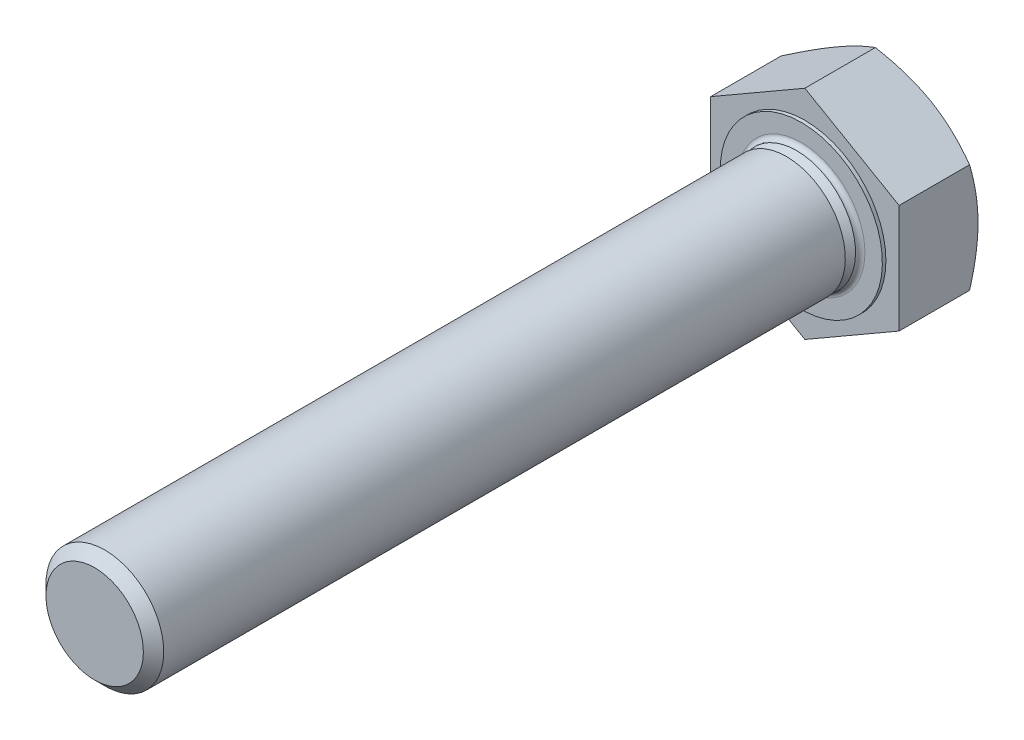
ISO-10303-21;
HEADER;
FILE_DESCRIPTION(('STEP AP214'),'2;1');
FILE_NAME('part.step','',(''),(''),'','','');
FILE_SCHEMA(('AUTOMOTIVE_DESIGN { 1 0 10303 214 1 1 1 1 }'));
ENDSEC;
DATA;
#1=APPLICATION_CONTEXT('core data for automotive mechanical design processes');
#2=APPLICATION_PROTOCOL_DEFINITION('international standard','automotive_design',2000,#1);
#3=PRODUCT_CONTEXT('',#1,'mechanical');
#4=PRODUCT('Part','Part','',(#3));
#5=PRODUCT_RELATED_PRODUCT_CATEGORY('part','',(#4));
#6=PRODUCT_DEFINITION_FORMATION('','',#4);
#7=PRODUCT_DEFINITION_CONTEXT('part definition',#1,'design');
#8=PRODUCT_DEFINITION('design','',#6,#7);
#9=PRODUCT_DEFINITION_SHAPE('','',#8);
#10=(LENGTH_UNIT() NAMED_UNIT(*) SI_UNIT(.MILLI.,.METRE.));
#11=(NAMED_UNIT(*) PLANE_ANGLE_UNIT() SI_UNIT($,.RADIAN.));
#12=(NAMED_UNIT(*) SI_UNIT($,.STERADIAN.) SOLID_ANGLE_UNIT());
#13=UNCERTAINTY_MEASURE_WITH_UNIT(LENGTH_MEASURE(1.E-05),#10,'distance_accuracy_value','');
#14=(GEOMETRIC_REPRESENTATION_CONTEXT(3) GLOBAL_UNCERTAINTY_ASSIGNED_CONTEXT((#13)) GLOBAL_UNIT_ASSIGNED_CONTEXT((#10,
#11,#12)) REPRESENTATION_CONTEXT('',''));
#15=CARTESIAN_POINT('',(0.,0.,0.));
#16=DIRECTION('',(0.,0.,1.));
#17=DIRECTION('',(1.,0.,0.));
#18=AXIS2_PLACEMENT_3D('',#15,#16,#17);
#19=CARTESIAN_POINT('',(0.,1.0335,30.));
#20=DIRECTION('',(0.,0.,1.));
#21=DIRECTION('',(0.,1.,0.));
#22=AXIS2_PLACEMENT_3D('',#19,#20,#21);
#23=PLANE('',#22);
#24=CARTESIAN_POINT('',(0.,0.,30.));
#25=DIRECTION('',(0.,0.,1.));
#26=DIRECTION('',(0.,1.,0.));
#27=AXIS2_PLACEMENT_3D('',#24,#25,#26);
#28=CIRCLE('',#27,2.067);
#29=CARTESIAN_POINT('',(0.,2.067,30.));
#30=VERTEX_POINT('',#29);
#31=EDGE_CURVE('E11',#30,#30,#28,.T.);
#32=ORIENTED_EDGE('',*,*,#31,.T.);
#33=EDGE_LOOP('',(#32));
#34=FACE_BOUND('',#33,.T.);
#35=ADVANCED_FACE('F17',(#34),#23,.T.);
#36=CARTESIAN_POINT('',(0.,0.,29.7835));
#37=DIRECTION('',(0.,0.,-1.));
#38=DIRECTION('',(0.,1.,0.));
#39=AXIS2_PLACEMENT_3D('',#36,#37,#38);
#40=CONICAL_SURFACE('',#39,2.2835,0.785398163397448);
#41=CARTESIAN_POINT('',(0.,0.,29.567));
#42=DIRECTION('',(0.,0.,1.));
#43=DIRECTION('',(0.,1.,0.));
#44=AXIS2_PLACEMENT_3D('',#41,#42,#43);
#45=CIRCLE('',#44,2.5);
#46=CARTESIAN_POINT('',(0.,2.5,29.567));
#47=VERTEX_POINT('',#46);
#48=EDGE_CURVE('E29',#47,#47,#45,.T.);
#49=ORIENTED_EDGE('',*,*,#48,.T.);
#50=EDGE_LOOP('',(#49));
#51=FACE_BOUND('',#50,.T.);
#52=ORIENTED_EDGE('',*,*,#31,.F.);
#53=EDGE_LOOP('',(#52));
#54=FACE_BOUND('',#53,.T.);
#55=ADVANCED_FACE('F290',(#51,#54),#40,.T.);
#56=CARTESIAN_POINT('',(0.,0.,15.1));
#57=DIRECTION('',(0.,0.,-1.));
#58=DIRECTION('',(0.,1.,0.));
#59=AXIS2_PLACEMENT_3D('',#56,#57,#58);
#60=CYLINDRICAL_SURFACE('',#59,2.5);
#61=CARTESIAN_POINT('',(0.,0.,0.633));
#62=DIRECTION('',(0.,0.,1.));
#63=DIRECTION('',(0.,1.,0.));
#64=AXIS2_PLACEMENT_3D('',#61,#62,#63);
#65=CIRCLE('',#64,2.5);
#66=CARTESIAN_POINT('',(0.,2.5,0.633));
#67=VERTEX_POINT('',#66);
#68=EDGE_CURVE('E178',#67,#67,#65,.T.);
#69=ORIENTED_EDGE('',*,*,#68,.T.);
#70=EDGE_LOOP('',(#69));
#71=FACE_BOUND('',#70,.T.);
#72=ORIENTED_EDGE('',*,*,#48,.F.);
#73=EDGE_LOOP('',(#72));
#74=FACE_BOUND('',#73,.T.);
#75=ADVANCED_FACE('F295',(#71,#74),#60,.T.);
#76=CARTESIAN_POINT('',(0.,2.2835,0.633));
#77=DIRECTION('',(0.,0.,-1.));
#78=DIRECTION('',(0.,-1.,0.));
#79=AXIS2_PLACEMENT_3D('',#76,#77,#78);
#80=PLANE('',#79);
#81=CARTESIAN_POINT('',(0.,0.,0.633));
#82=DIRECTION('',(0.,0.,1.));
#83=DIRECTION('',(0.,1.,0.));
#84=AXIS2_PLACEMENT_3D('',#81,#82,#83);
#85=CIRCLE('',#84,2.067);
#86=CARTESIAN_POINT('',(0.,2.067,0.633));
#87=VERTEX_POINT('',#86);
#88=EDGE_CURVE('E176',#87,#87,#85,.T.);
#89=ORIENTED_EDGE('',*,*,#88,.T.);
#90=EDGE_LOOP('',(#89));
#91=FACE_BOUND('',#90,.T.);
#92=ORIENTED_EDGE('',*,*,#68,.F.);
#93=EDGE_LOOP('',(#92));
#94=FACE_BOUND('',#93,.T.);
#95=ADVANCED_FACE('F285',(#91,#94),#80,.T.);
#96=CARTESIAN_POINT('',(0.,0.,0.4165));
#97=DIRECTION('',(0.,0.,-1.));
#98=DIRECTION('',(0.,1.,0.));
#99=AXIS2_PLACEMENT_3D('',#96,#97,#98);
#100=CONICAL_SURFACE('',#99,2.2835,0.785398163397448);
#101=CARTESIAN_POINT('',(0.,0.,0.2));
#102=DIRECTION('',(0.,0.,1.));
#103=DIRECTION('',(0.,1.,0.));
#104=AXIS2_PLACEMENT_3D('',#101,#102,#103);
#105=CIRCLE('',#104,2.5);
#106=CARTESIAN_POINT('',(0.,2.5,0.2));
#107=VERTEX_POINT('',#106);
#108=EDGE_CURVE('E179',#107,#107,#105,.T.);
#109=ORIENTED_EDGE('',*,*,#108,.T.);
#110=EDGE_LOOP('',(#109));
#111=FACE_BOUND('',#110,.T.);
#112=ORIENTED_EDGE('',*,*,#88,.F.);
#113=EDGE_LOOP('',(#112));
#114=FACE_BOUND('',#113,.T.);
#115=ADVANCED_FACE('F269',(#111,#114),#100,.T.);
#116=CARTESIAN_POINT('',(0.,0.,0.2));
#117=DIRECTION('',(0.,0.,1.));
#118=DIRECTION('',(1.,0.,0.));
#119=AXIS2_PLACEMENT_3D('',#116,#117,#118);
#120=TOROIDAL_SURFACE('',#119,2.7,0.2);
#121=CARTESIAN_POINT('',(0.,0.,0.));
#122=DIRECTION('',(0.,0.,1.));
#123=DIRECTION('',(0.,1.,0.));
#124=AXIS2_PLACEMENT_3D('',#121,#122,#123);
#125=CIRCLE('',#124,2.7);
#126=CARTESIAN_POINT('',(0.,2.7,0.));
#127=VERTEX_POINT('',#126);
#128=EDGE_CURVE('E183',#127,#127,#125,.T.);
#129=ORIENTED_EDGE('',*,*,#128,.T.);
#130=EDGE_LOOP('',(#129));
#131=FACE_BOUND('',#130,.T.);
#132=ORIENTED_EDGE('',*,*,#108,.F.);
#133=EDGE_LOOP('',(#132));
#134=FACE_BOUND('',#133,.T.);
#135=ADVANCED_FACE('F272',(#131,#134),#120,.F.);
#136=CARTESIAN_POINT('',(0.,3.07,0.));
#137=DIRECTION('',(0.,0.,1.));
#138=DIRECTION('',(0.,1.,0.));
#139=AXIS2_PLACEMENT_3D('',#136,#137,#138);
#140=PLANE('',#139);
#141=CARTESIAN_POINT('',(0.,0.,0.));
#142=DIRECTION('',(0.,0.,1.));
#143=DIRECTION('',(0.,1.,0.));
#144=AXIS2_PLACEMENT_3D('',#141,#142,#143);
#145=CIRCLE('',#144,3.44);
#146=CARTESIAN_POINT('',(0.,3.44,0.));
#147=VERTEX_POINT('',#146);
#148=EDGE_CURVE('E119',#147,#147,#145,.T.);
#149=ORIENTED_EDGE('',*,*,#148,.T.);
#150=EDGE_LOOP('',(#149));
#151=FACE_BOUND('',#150,.T.);
#152=ORIENTED_EDGE('',*,*,#128,.F.);
#153=EDGE_LOOP('',(#152));
#154=FACE_BOUND('',#153,.T.);
#155=ADVANCED_FACE('F274',(#151,#154),#140,.T.);
#156=CARTESIAN_POINT('',(0.,0.,-0.325));
#157=DIRECTION('',(0.,0.,-1.));
#158=DIRECTION('',(0.,1.,0.));
#159=AXIS2_PLACEMENT_3D('',#156,#157,#158);
#160=CYLINDRICAL_SURFACE('',#159,3.44);
#161=ORIENTED_EDGE('',*,*,#148,.F.);
#162=EDGE_LOOP('',(#161));
#163=FACE_BOUND('',#162,.T.);
#164=CARTESIAN_POINT('',(0.,0.,-0.15));
#165=DIRECTION('',(0.,0.,1.));
#166=DIRECTION('',(0.,1.,0.));
#167=AXIS2_PLACEMENT_3D('',#164,#165,#166);
#168=CIRCLE('',#167,3.44);
#169=CARTESIAN_POINT('',(0.,-3.44,-0.15));
#170=VERTEX_POINT('',#169);
#171=EDGE_CURVE('E130',#170,#170,#168,.T.);
#172=ORIENTED_EDGE('',*,*,#171,.T.);
#173=EDGE_LOOP('',(#172));
#174=FACE_BOUND('',#173,.T.);
#175=ADVANCED_FACE('F282',(#163,#174),#160,.T.);
#176=CARTESIAN_POINT('',(-2.,-3.46410161513775,0.85));
#177=DIRECTION('',(-0.5,-0.866025403784439,0.));
#178=DIRECTION('',(-0.866025403784439,0.5,0.));
#179=AXIS2_PLACEMENT_3D('',#176,#177,#178);
#180=PLANE('',#179);
#181=CARTESIAN_POINT('',(0.00207392470907665,-4.61999953450607,-3.14204283310244));
#182=CARTESIAN_POINT('',(-1.07096337600507,-4.00048116008825,-3.5));
#183=CARTESIAN_POINT('',(-2.,-3.46410161513775,-3.5));
#184=CARTESIAN_POINT('',(-2.92903662399493,-2.92772207018725,-3.5));
#185=CARTESIAN_POINT('',(-4.00207392470907,-2.30820369576944,-3.14204283310243));
#186=(BOUNDED_CURVE() B_SPLINE_CURVE(2,(#181,#182,#183,#184,#185),.UNSPECIFIED.,.F.,
.F.) B_SPLINE_CURVE_WITH_KNOTS((3,2,3),(0.,2.34532655900568,4.69065311801136),
.UNSPECIFIED.) CURVE() GEOMETRIC_REPRESENTATION_ITEM() RATIONAL_B_SPLINE_CURVE((1.,
1.03802697460134,1.,1.03802697460134,1.)) REPRESENTATION_ITEM(''));
#187=CARTESIAN_POINT('',(0.,-4.61880215351701,-3.14273441009184));
#188=VERTEX_POINT('',#187);
#189=CARTESIAN_POINT('',(-2.,-3.46410161513775,-3.5));
#190=VERTEX_POINT('',#189);
#191=EDGE_CURVE('E21',#188,#190,#186,.T.);
#192=ORIENTED_EDGE('',*,*,#191,.F.);
#193=DIRECTION('',(0.,0.,-1.));
#194=VECTOR('',#193,1.);
#195=CARTESIAN_POINT('',(0.,-4.61880215351701,0.85));
#196=LINE('',#195,#194);
#197=CARTESIAN_POINT('',(0.,-4.61880215351701,-0.15));
#198=VERTEX_POINT('',#197);
#199=EDGE_CURVE('E108',#198,#188,#196,.T.);
#200=ORIENTED_EDGE('',*,*,#199,.F.);
#201=DIRECTION('',(0.866025403784439,-0.5,0.));
#202=VECTOR('',#201,1.);
#203=CARTESIAN_POINT('',(-1.49987032931449,-3.75285161513775,-0.15));
#204=LINE('',#203,#202);
#205=CARTESIAN_POINT('',(-4.,-2.30940107675851,-0.15));
#206=VERTEX_POINT('',#205);
#207=EDGE_CURVE('E111',#206,#198,#204,.T.);
#208=ORIENTED_EDGE('',*,*,#207,.F.);
#209=DIRECTION('',(0.,0.,-1.));
#210=VECTOR('',#209,1.);
#211=CARTESIAN_POINT('',(-4.,-2.30940107675851,0.85));
#212=LINE('',#211,#210);
#213=CARTESIAN_POINT('',(-4.,-2.30940107675851,-3.14273441009184));
#214=VERTEX_POINT('',#213);
#215=EDGE_CURVE('E168',#206,#214,#212,.T.);
#216=ORIENTED_EDGE('',*,*,#215,.T.);
#217=CARTESIAN_POINT('',(0.00207392470907665,-4.61999953450607,-3.14204283310244));
#218=CARTESIAN_POINT('',(-1.07096337600507,-4.00048116008825,-3.5));
#219=CARTESIAN_POINT('',(-2.,-3.46410161513775,-3.5));
#220=CARTESIAN_POINT('',(-2.92903662399493,-2.92772207018725,-3.5));
#221=CARTESIAN_POINT('',(-4.00207392470907,-2.30820369576944,-3.14204283310243));
#222=(BOUNDED_CURVE() B_SPLINE_CURVE(2,(#217,#218,#219,#220,#221),.UNSPECIFIED.,.F.,
.F.) B_SPLINE_CURVE_WITH_KNOTS((3,2,3),(0.,2.34532655900568,4.69065311801136),
.UNSPECIFIED.) CURVE() GEOMETRIC_REPRESENTATION_ITEM() RATIONAL_B_SPLINE_CURVE((1.,
1.03802697460134,1.,1.03802697460134,1.)) REPRESENTATION_ITEM(''));
#223=EDGE_CURVE('E144',#190,#214,#222,.T.);
#224=ORIENTED_EDGE('',*,*,#223,.F.);
#225=EDGE_LOOP('',(#192,#200,#208,#216,#224));
#226=FACE_BOUND('',#225,.T.);
#227=ADVANCED_FACE('F110',(#226),#180,.T.);
#228=CARTESIAN_POINT('',(4.,0.,0.85));
#229=DIRECTION('',(1.,0.,0.));
#230=DIRECTION('',(0.,-1.,0.));
#231=AXIS2_PLACEMENT_3D('',#228,#229,#230);
#232=PLANE('',#231);
#233=CARTESIAN_POINT('',(4.,2.31179583873663,-3.14204283310243));
#234=CARTESIAN_POINT('',(4.,1.072759089901,-3.5));
#235=CARTESIAN_POINT('',(4.,0.,-3.5));
#236=CARTESIAN_POINT('',(4.,-1.07275908990099,-3.5));
#237=CARTESIAN_POINT('',(4.,-2.31179583873663,-3.14204283310243));
#238=(BOUNDED_CURVE() B_SPLINE_CURVE(2,(#233,#234,#235,#236,#237),.UNSPECIFIED.,.F.,
.F.) B_SPLINE_CURVE_WITH_KNOTS((3,2,3),(0.,2.34532655900568,4.69065311801136),
.UNSPECIFIED.) CURVE() GEOMETRIC_REPRESENTATION_ITEM() RATIONAL_B_SPLINE_CURVE((1.,
1.03802697460136,1.,1.03802697460136,1.)) REPRESENTATION_ITEM(''));
#239=CARTESIAN_POINT('',(4.,2.30940107675851,-3.14273441009184));
#240=VERTEX_POINT('',#239);
#241=CARTESIAN_POINT('',(4.,0.,-3.5));
#242=VERTEX_POINT('',#241);
#243=EDGE_CURVE('E252',#240,#242,#238,.T.);
#244=ORIENTED_EDGE('',*,*,#243,.F.);
#245=DIRECTION('',(0.,0.,-1.));
#246=VECTOR('',#245,1.);
#247=CARTESIAN_POINT('',(4.,2.30940107675851,0.85));
#248=LINE('',#247,#246);
#249=CARTESIAN_POINT('',(4.,2.30940107675851,-0.15));
#250=VERTEX_POINT('',#249);
#251=EDGE_CURVE('E167',#250,#240,#248,.T.);
#252=ORIENTED_EDGE('',*,*,#251,.F.);
#253=DIRECTION('',(0.,1.,0.));
#254=VECTOR('',#253,1.);
#255=CARTESIAN_POINT('',(4.,-1.155,-0.15));
#256=LINE('',#255,#254);
#257=CARTESIAN_POINT('',(4.,-2.30940107675851,-0.15));
#258=VERTEX_POINT('',#257);
#259=EDGE_CURVE('E135',#258,#250,#256,.T.);
#260=ORIENTED_EDGE('',*,*,#259,.F.);
#261=DIRECTION('',(0.,0.,-1.));
#262=VECTOR('',#261,1.);
#263=CARTESIAN_POINT('',(4.,-2.30940107675851,0.85));
#264=LINE('',#263,#262);
#265=CARTESIAN_POINT('',(4.,-2.3094010767585,-3.14273441009184));
#266=VERTEX_POINT('',#265);
#267=EDGE_CURVE('E120',#258,#266,#264,.T.);
#268=ORIENTED_EDGE('',*,*,#267,.T.);
#269=CARTESIAN_POINT('',(4.,2.31179583873663,-3.14204283310243));
#270=CARTESIAN_POINT('',(4.,1.072759089901,-3.5));
#271=CARTESIAN_POINT('',(4.,0.,-3.5));
#272=CARTESIAN_POINT('',(4.,-1.07275908990099,-3.5));
#273=CARTESIAN_POINT('',(4.,-2.31179583873663,-3.14204283310243));
#274=(BOUNDED_CURVE() B_SPLINE_CURVE(2,(#269,#270,#271,#272,#273),.UNSPECIFIED.,.F.,
.F.) B_SPLINE_CURVE_WITH_KNOTS((3,2,3),(0.,2.34532655900568,4.69065311801136),
.UNSPECIFIED.) CURVE() GEOMETRIC_REPRESENTATION_ITEM() RATIONAL_B_SPLINE_CURVE((1.,
1.03802697460136,1.,1.03802697460136,1.)) REPRESENTATION_ITEM(''));
#275=EDGE_CURVE('E198',#242,#266,#274,.T.);
#276=ORIENTED_EDGE('',*,*,#275,.F.);
#277=EDGE_LOOP('',(#244,#252,#260,#268,#276));
#278=FACE_BOUND('',#277,.T.);
#279=ADVANCED_FACE('F19',(#278),#232,.T.);
#280=CARTESIAN_POINT('',(2.,-3.46410161513775,0.85));
#281=DIRECTION('',(0.5,-0.866025403784439,0.));
#282=DIRECTION('',(-0.866025403784439,-0.5,0.));
#283=AXIS2_PLACEMENT_3D('',#280,#281,#282);
#284=PLANE('',#283);
#285=CARTESIAN_POINT('',(4.00207392470908,-2.30820369576943,-3.14204283310243));
#286=CARTESIAN_POINT('',(2.92903662399494,-2.92772207018725,-3.5));
#287=CARTESIAN_POINT('',(2.,-3.46410161513775,-3.5));
#288=CARTESIAN_POINT('',(1.07096337600506,-4.00048116008825,-3.49999999999999));
#289=CARTESIAN_POINT('',(-0.00207392470907678,-4.61999953450607,-3.14204283310244));
#290=(BOUNDED_CURVE() B_SPLINE_CURVE(2,(#285,#286,#287,#288,#289),.UNSPECIFIED.,.F.,
.F.) B_SPLINE_CURVE_WITH_KNOTS((3,2,3),(0.,2.34532655900568,4.69065311801136),
.UNSPECIFIED.) CURVE() GEOMETRIC_REPRESENTATION_ITEM() RATIONAL_B_SPLINE_CURVE((1.,
1.03802697460135,1.,1.03802697460134,1.)) REPRESENTATION_ITEM(''));
#291=CARTESIAN_POINT('',(2.,-3.46410161513775,-3.5));
#292=VERTEX_POINT('',#291);
#293=EDGE_CURVE('E175',#266,#292,#290,.T.);
#294=ORIENTED_EDGE('',*,*,#293,.F.);
#295=ORIENTED_EDGE('',*,*,#267,.F.);
#296=DIRECTION('',(0.866025403784439,0.5,0.));
#297=VECTOR('',#296,1.);
#298=CARTESIAN_POINT('',(1.49987032931449,-3.75285161513775,-0.15));
#299=LINE('',#298,#297);
#300=EDGE_CURVE('E126',#198,#258,#299,.T.);
#301=ORIENTED_EDGE('',*,*,#300,.F.);
#302=ORIENTED_EDGE('',*,*,#199,.T.);
#303=CARTESIAN_POINT('',(4.00207392470908,-2.30820369576943,-3.14204283310243));
#304=CARTESIAN_POINT('',(2.92903662399494,-2.92772207018725,-3.5));
#305=CARTESIAN_POINT('',(2.,-3.46410161513775,-3.5));
#306=CARTESIAN_POINT('',(1.07096337600506,-4.00048116008825,-3.49999999999999));
#307=CARTESIAN_POINT('',(-0.00207392470907678,-4.61999953450607,-3.14204283310244));
#308=(BOUNDED_CURVE() B_SPLINE_CURVE(2,(#303,#304,#305,#306,#307),.UNSPECIFIED.,.F.,
.F.) B_SPLINE_CURVE_WITH_KNOTS((3,2,3),(0.,2.34532655900568,4.69065311801136),
.UNSPECIFIED.) CURVE() GEOMETRIC_REPRESENTATION_ITEM() RATIONAL_B_SPLINE_CURVE((1.,
1.03802697460135,1.,1.03802697460134,1.)) REPRESENTATION_ITEM(''));
#309=EDGE_CURVE('E174',#292,#188,#308,.T.);
#310=ORIENTED_EDGE('',*,*,#309,.F.);
#311=EDGE_LOOP('',(#294,#295,#301,#302,#310));
#312=FACE_BOUND('',#311,.T.);
#313=ADVANCED_FACE('F133',(#312),#284,.T.);
#314=CARTESIAN_POINT('',(-4.,0.,0.85));
#315=DIRECTION('',(-1.,0.,0.));
#316=DIRECTION('',(0.,1.,0.));
#317=AXIS2_PLACEMENT_3D('',#314,#315,#316);
#318=PLANE('',#317);
#319=CARTESIAN_POINT('',(-4.,-2.31179583873663,-3.14204283310243));
#320=CARTESIAN_POINT('',(-4.,-1.07275908990099,-3.5));
#321=CARTESIAN_POINT('',(-4.,0.,-3.5));
#322=CARTESIAN_POINT('',(-4.,1.07275908990099,-3.5));
#323=CARTESIAN_POINT('',(-4.,2.31179583873663,-3.14204283310243));
#324=(BOUNDED_CURVE() B_SPLINE_CURVE(2,(#319,#320,#321,#322,#323),.UNSPECIFIED.,.F.,
.F.) B_SPLINE_CURVE_WITH_KNOTS((3,2,3),(0.,2.34532655900568,4.69065311801136),
.UNSPECIFIED.) CURVE() GEOMETRIC_REPRESENTATION_ITEM() RATIONAL_B_SPLINE_CURVE((1.,
1.03802697460135,1.,1.03802697460135,1.)) REPRESENTATION_ITEM(''));
#325=CARTESIAN_POINT('',(-4.,0.,-3.5));
#326=VERTEX_POINT('',#325);
#327=CARTESIAN_POINT('',(-4.,2.3094010767585,-3.14273441009184));
#328=VERTEX_POINT('',#327);
#329=EDGE_CURVE('E161',#326,#328,#324,.T.);
#330=ORIENTED_EDGE('',*,*,#329,.F.);
#331=CARTESIAN_POINT('',(-4.,-2.31179583873663,-3.14204283310243));
#332=CARTESIAN_POINT('',(-4.,-1.07275908990099,-3.5));
#333=CARTESIAN_POINT('',(-4.,0.,-3.5));
#334=CARTESIAN_POINT('',(-4.,1.07275908990099,-3.5));
#335=CARTESIAN_POINT('',(-4.,2.31179583873663,-3.14204283310243));
#336=(BOUNDED_CURVE() B_SPLINE_CURVE(2,(#331,#332,#333,#334,#335),.UNSPECIFIED.,.F.,
.F.) B_SPLINE_CURVE_WITH_KNOTS((3,2,3),(0.,2.34532655900568,4.69065311801136),
.UNSPECIFIED.) CURVE() GEOMETRIC_REPRESENTATION_ITEM() RATIONAL_B_SPLINE_CURVE((1.,
1.03802697460135,1.,1.03802697460135,1.)) REPRESENTATION_ITEM(''));
#337=EDGE_CURVE('E149',#214,#326,#336,.T.);
#338=ORIENTED_EDGE('',*,*,#337,.F.);
#339=ORIENTED_EDGE('',*,*,#215,.F.);
#340=DIRECTION('',(0.,-1.,0.));
#341=VECTOR('',#340,1.);
#342=CARTESIAN_POINT('',(-4.,-1.155,-0.15));
#343=LINE('',#342,#341);
#344=CARTESIAN_POINT('',(-4.,2.3094010767585,-0.15));
#345=VERTEX_POINT('',#344);
#346=EDGE_CURVE('E129',#345,#206,#343,.T.);
#347=ORIENTED_EDGE('',*,*,#346,.F.);
#348=DIRECTION('',(0.,0.,-1.));
#349=VECTOR('',#348,1.);
#350=CARTESIAN_POINT('',(-4.,2.3094010767585,0.85));
#351=LINE('',#350,#349);
#352=EDGE_CURVE('E233',#345,#328,#351,.T.);
#353=ORIENTED_EDGE('',*,*,#352,.T.);
#354=EDGE_LOOP('',(#330,#338,#339,#347,#353));
#355=FACE_BOUND('',#354,.T.);
#356=ADVANCED_FACE('F316',(#355),#318,.T.);
#357=CARTESIAN_POINT('',(2.,3.46410161513775,0.85));
#358=DIRECTION('',(0.5,0.866025403784439,0.));
#359=DIRECTION('',(0.866025403784439,-0.5,0.));
#360=AXIS2_PLACEMENT_3D('',#357,#358,#359);
#361=PLANE('',#360);
#362=CARTESIAN_POINT('',(-0.00207392470907844,4.61999953450607,-3.14204283310243));
#363=CARTESIAN_POINT('',(1.07096337600507,4.00048116008825,-3.5));
#364=CARTESIAN_POINT('',(2.,3.46410161513775,-3.5));
#365=CARTESIAN_POINT('',(2.92903662399493,2.92772207018726,-3.5));
#366=CARTESIAN_POINT('',(4.00207392470907,2.30820369576944,-3.14204283310243));
#367=(BOUNDED_CURVE() B_SPLINE_CURVE(2,(#362,#363,#364,#365,#366),.UNSPECIFIED.,.F.,
.F.) B_SPLINE_CURVE_WITH_KNOTS((3,2,3),(0.,2.34532655900568,4.69065311801136),
.UNSPECIFIED.) CURVE() GEOMETRIC_REPRESENTATION_ITEM() RATIONAL_B_SPLINE_CURVE((1.,
1.03802697460135,1.,1.03802697460133,1.)) REPRESENTATION_ITEM(''));
#368=CARTESIAN_POINT('',(2.,3.46410161513775,-3.5));
#369=VERTEX_POINT('',#368);
#370=EDGE_CURVE('E193',#369,#240,#367,.T.);
#371=ORIENTED_EDGE('',*,*,#370,.F.);
#372=CARTESIAN_POINT('',(-0.00207392470907844,4.61999953450607,-3.14204283310243));
#373=CARTESIAN_POINT('',(1.07096337600507,4.00048116008825,-3.5));
#374=CARTESIAN_POINT('',(2.,3.46410161513775,-3.5));
#375=CARTESIAN_POINT('',(2.92903662399493,2.92772207018726,-3.5));
#376=CARTESIAN_POINT('',(4.00207392470907,2.30820369576944,-3.14204283310243));
#377=(BOUNDED_CURVE() B_SPLINE_CURVE(2,(#372,#373,#374,#375,#376),.UNSPECIFIED.,.F.,
.F.) B_SPLINE_CURVE_WITH_KNOTS((3,2,3),(0.,2.34532655900568,4.69065311801136),
.UNSPECIFIED.) CURVE() GEOMETRIC_REPRESENTATION_ITEM() RATIONAL_B_SPLINE_CURVE((1.,
1.03802697460135,1.,1.03802697460133,1.)) REPRESENTATION_ITEM(''));
#378=CARTESIAN_POINT('',(0.,4.61880215351701,-3.14273441009184));
#379=VERTEX_POINT('',#378);
#380=EDGE_CURVE('E157',#379,#369,#377,.T.);
#381=ORIENTED_EDGE('',*,*,#380,.F.);
#382=DIRECTION('',(0.,0.,-1.));
#383=VECTOR('',#382,1.);
#384=CARTESIAN_POINT('',(0.,4.61880215351701,0.85));
#385=LINE('',#384,#383);
#386=CARTESIAN_POINT('',(0.,4.61880215351701,-0.15));
#387=VERTEX_POINT('',#386);
#388=EDGE_CURVE('E169',#387,#379,#385,.T.);
#389=ORIENTED_EDGE('',*,*,#388,.F.);
#390=DIRECTION('',(-0.866025403784439,0.5,0.));
#391=VECTOR('',#390,1.);
#392=CARTESIAN_POINT('',(2.50012967068551,3.17535161513775,-0.15));
#393=LINE('',#392,#391);
#394=EDGE_CURVE('E137',#250,#387,#393,.T.);
#395=ORIENTED_EDGE('',*,*,#394,.F.);
#396=ORIENTED_EDGE('',*,*,#251,.T.);
#397=EDGE_LOOP('',(#371,#381,#389,#395,#396));
#398=FACE_BOUND('',#397,.T.);
#399=ADVANCED_FACE('F319',(#398),#361,.T.);
#400=CARTESIAN_POINT('',(-2.,3.46410161513775,0.85));
#401=DIRECTION('',(-0.5,0.866025403784439,0.));
#402=DIRECTION('',(0.866025403784439,0.5,0.));
#403=AXIS2_PLACEMENT_3D('',#400,#401,#402);
#404=PLANE('',#403);
#405=CARTESIAN_POINT('',(-4.00207392470908,2.30820369576943,-3.14204283310243));
#406=CARTESIAN_POINT('',(-2.92903662399493,2.92772207018726,-3.5));
#407=CARTESIAN_POINT('',(-2.,3.46410161513775,-3.5));
#408=CARTESIAN_POINT('',(-1.07096337600507,4.00048116008824,-3.49999999999999));
#409=CARTESIAN_POINT('',(0.00207392470907665,4.61999953450607,-3.14204283310243));
#410=(BOUNDED_CURVE() B_SPLINE_CURVE(2,(#405,#406,#407,#408,#409),.UNSPECIFIED.,.F.,
.F.) B_SPLINE_CURVE_WITH_KNOTS((3,2,3),(0.,2.34532655900568,4.69065311801136),
.UNSPECIFIED.) CURVE() GEOMETRIC_REPRESENTATION_ITEM() RATIONAL_B_SPLINE_CURVE((1.,
1.03802697460134,1.,1.03802697460134,1.)) REPRESENTATION_ITEM(''));
#411=CARTESIAN_POINT('',(-2.,3.46410161513775,-3.5));
#412=VERTEX_POINT('',#411);
#413=EDGE_CURVE('E141',#412,#379,#410,.T.);
#414=ORIENTED_EDGE('',*,*,#413,.F.);
#415=CARTESIAN_POINT('',(-4.00207392470908,2.30820369576943,-3.14204283310243));
#416=CARTESIAN_POINT('',(-2.92903662399493,2.92772207018726,-3.5));
#417=CARTESIAN_POINT('',(-2.,3.46410161513775,-3.5));
#418=CARTESIAN_POINT('',(-1.07096337600507,4.00048116008824,-3.49999999999999));
#419=CARTESIAN_POINT('',(0.00207392470907665,4.61999953450607,-3.14204283310243));
#420=(BOUNDED_CURVE() B_SPLINE_CURVE(2,(#415,#416,#417,#418,#419),.UNSPECIFIED.,.F.,
.F.) B_SPLINE_CURVE_WITH_KNOTS((3,2,3),(0.,2.34532655900568,4.69065311801136),
.UNSPECIFIED.) CURVE() GEOMETRIC_REPRESENTATION_ITEM() RATIONAL_B_SPLINE_CURVE((1.,
1.03802697460134,1.,1.03802697460134,1.)) REPRESENTATION_ITEM(''));
#421=EDGE_CURVE('E162',#328,#412,#420,.T.);
#422=ORIENTED_EDGE('',*,*,#421,.F.);
#423=ORIENTED_EDGE('',*,*,#352,.F.);
#424=DIRECTION('',(-0.866025403784439,-0.5,0.));
#425=VECTOR('',#424,1.);
#426=CARTESIAN_POINT('',(-2.50012967068552,3.17535161513775,-0.15));
#427=LINE('',#426,#425);
#428=EDGE_CURVE('E165',#387,#345,#427,.T.);
#429=ORIENTED_EDGE('',*,*,#428,.F.);
#430=ORIENTED_EDGE('',*,*,#388,.T.);
#431=EDGE_LOOP('',(#414,#422,#423,#429,#430));
#432=FACE_BOUND('',#431,.T.);
#433=ADVANCED_FACE('F346',(#432),#404,.T.);
#434=CARTESIAN_POINT('',(0.,-2.,-3.5));
#435=DIRECTION('',(0.,0.,-1.));
#436=DIRECTION('',(0.,-1.,0.));
#437=AXIS2_PLACEMENT_3D('',#434,#435,#436);
#438=PLANE('',#437);
#439=CARTESIAN_POINT('',(0.,0.,-3.5));
#440=DIRECTION('',(0.,0.,-1.));
#441=DIRECTION('',(0.,-1.,0.));
#442=AXIS2_PLACEMENT_3D('',#439,#440,#441);
#443=CIRCLE('',#442,4.);
#444=EDGE_CURVE('E150',#292,#190,#443,.T.);
#445=ORIENTED_EDGE('',*,*,#444,.T.);
#446=CARTESIAN_POINT('',(0.,0.,-3.5));
#447=DIRECTION('',(0.,0.,-1.));
#448=DIRECTION('',(0.,-1.,0.));
#449=AXIS2_PLACEMENT_3D('',#446,#447,#448);
#450=CIRCLE('',#449,4.);
#451=EDGE_CURVE('E188',#190,#326,#450,.T.);
#452=ORIENTED_EDGE('',*,*,#451,.T.);
#453=CARTESIAN_POINT('',(0.,0.,-3.5));
#454=DIRECTION('',(0.,0.,-1.));
#455=DIRECTION('',(0.,-1.,0.));
#456=AXIS2_PLACEMENT_3D('',#453,#454,#455);
#457=CIRCLE('',#456,4.);
#458=EDGE_CURVE('E158',#326,#412,#457,.T.);
#459=ORIENTED_EDGE('',*,*,#458,.T.);
#460=CARTESIAN_POINT('',(0.,0.,-3.5));
#461=DIRECTION('',(0.,0.,-1.));
#462=DIRECTION('',(0.,-1.,0.));
#463=AXIS2_PLACEMENT_3D('',#460,#461,#462);
#464=CIRCLE('',#463,4.);
#465=EDGE_CURVE('E151',#412,#369,#464,.T.);
#466=ORIENTED_EDGE('',*,*,#465,.T.);
#467=CARTESIAN_POINT('',(0.,0.,-3.5));
#468=DIRECTION('',(0.,0.,-1.));
#469=DIRECTION('',(0.,-1.,0.));
#470=AXIS2_PLACEMENT_3D('',#467,#468,#469);
#471=CIRCLE('',#470,4.);
#472=EDGE_CURVE('E199',#369,#242,#471,.T.);
#473=ORIENTED_EDGE('',*,*,#472,.T.);
#474=CARTESIAN_POINT('',(0.,0.,-3.5));
#475=DIRECTION('',(0.,0.,-1.));
#476=DIRECTION('',(0.,-1.,0.));
#477=AXIS2_PLACEMENT_3D('',#474,#475,#476);
#478=CIRCLE('',#477,4.);
#479=EDGE_CURVE('E171',#242,#292,#478,.T.);
#480=ORIENTED_EDGE('',*,*,#479,.T.);
#481=EDGE_LOOP('',(#445,#452,#459,#466,#473,#480));
#482=FACE_BOUND('',#481,.T.);
#483=ADVANCED_FACE('F342',(#482),#438,.T.);
#484=CARTESIAN_POINT('',(0.,0.,-3.32102141655121));
#485=DIRECTION('',(0.,0.,1.));
#486=DIRECTION('',(0.,-1.,0.));
#487=AXIS2_PLACEMENT_3D('',#484,#485,#486);
#488=CONICAL_SURFACE('',#487,4.31,1.0471975511966);
#489=ORIENTED_EDGE('',*,*,#223,.T.);
#490=ORIENTED_EDGE('',*,*,#337,.T.);
#491=ORIENTED_EDGE('',*,*,#451,.F.);
#492=EDGE_LOOP('',(#489,#490,#491));
#493=FACE_BOUND('',#492,.T.);
#494=ADVANCED_FACE('F351',(#493),#488,.T.);
#495=CARTESIAN_POINT('',(0.,0.,-3.32102141655121));
#496=DIRECTION('',(0.,0.,1.));
#497=DIRECTION('',(0.,-1.,0.));
#498=AXIS2_PLACEMENT_3D('',#495,#496,#497);
#499=CONICAL_SURFACE('',#498,4.31,1.0471975511966);
#500=ORIENTED_EDGE('',*,*,#309,.T.);
#501=ORIENTED_EDGE('',*,*,#191,.T.);
#502=ORIENTED_EDGE('',*,*,#444,.F.);
#503=EDGE_LOOP('',(#500,#501,#502));
#504=FACE_BOUND('',#503,.T.);
#505=ADVANCED_FACE('F311',(#504),#499,.T.);
#506=CARTESIAN_POINT('',(0.,0.,-3.32102141655121));
#507=DIRECTION('',(0.,0.,1.));
#508=DIRECTION('',(0.,-1.,0.));
#509=AXIS2_PLACEMENT_3D('',#506,#507,#508);
#510=CONICAL_SURFACE('',#509,4.31,1.0471975511966);
#511=ORIENTED_EDGE('',*,*,#275,.T.);
#512=ORIENTED_EDGE('',*,*,#293,.T.);
#513=ORIENTED_EDGE('',*,*,#479,.F.);
#514=EDGE_LOOP('',(#511,#512,#513));
#515=FACE_BOUND('',#514,.T.);
#516=ADVANCED_FACE('F308',(#515),#510,.T.);
#517=CARTESIAN_POINT('',(0.,0.,-3.32102141655121));
#518=DIRECTION('',(0.,0.,1.));
#519=DIRECTION('',(0.,-1.,0.));
#520=AXIS2_PLACEMENT_3D('',#517,#518,#519);
#521=CONICAL_SURFACE('',#520,4.31,1.0471975511966);
#522=ORIENTED_EDGE('',*,*,#243,.T.);
#523=ORIENTED_EDGE('',*,*,#472,.F.);
#524=ORIENTED_EDGE('',*,*,#370,.T.);
#525=EDGE_LOOP('',(#522,#523,#524));
#526=FACE_BOUND('',#525,.T.);
#527=ADVANCED_FACE('F300',(#526),#521,.T.);
#528=CARTESIAN_POINT('',(0.,0.,-3.32102141655121));
#529=DIRECTION('',(0.,0.,1.));
#530=DIRECTION('',(0.,-1.,0.));
#531=AXIS2_PLACEMENT_3D('',#528,#529,#530);
#532=CONICAL_SURFACE('',#531,4.31,1.0471975511966);
#533=ORIENTED_EDGE('',*,*,#380,.T.);
#534=ORIENTED_EDGE('',*,*,#465,.F.);
#535=ORIENTED_EDGE('',*,*,#413,.T.);
#536=EDGE_LOOP('',(#533,#534,#535));
#537=FACE_BOUND('',#536,.T.);
#538=ADVANCED_FACE('F324',(#537),#532,.T.);
#539=CARTESIAN_POINT('',(0.,0.,-3.32102141655121));
#540=DIRECTION('',(0.,0.,1.));
#541=DIRECTION('',(0.,-1.,0.));
#542=AXIS2_PLACEMENT_3D('',#539,#540,#541);
#543=CONICAL_SURFACE('',#542,4.31,1.0471975511966);
#544=ORIENTED_EDGE('',*,*,#421,.T.);
#545=ORIENTED_EDGE('',*,*,#458,.F.);
#546=ORIENTED_EDGE('',*,*,#329,.T.);
#547=EDGE_LOOP('',(#544,#545,#546));
#548=FACE_BOUND('',#547,.T.);
#549=ADVANCED_FACE('F305',(#548),#543,.T.);
#550=CARTESIAN_POINT('',(0.,-2.31,-0.15));
#551=DIRECTION('',(0.,0.,1.));
#552=DIRECTION('',(0.,1.,0.));
#553=AXIS2_PLACEMENT_3D('',#550,#551,#552);
#554=PLANE('',#553);
#555=ORIENTED_EDGE('',*,*,#171,.F.);
#556=EDGE_LOOP('',(#555));
#557=FACE_BOUND('',#556,.T.);
#558=ORIENTED_EDGE('',*,*,#300,.T.);
#559=ORIENTED_EDGE('',*,*,#259,.T.);
#560=ORIENTED_EDGE('',*,*,#394,.T.);
#561=ORIENTED_EDGE('',*,*,#428,.T.);
#562=ORIENTED_EDGE('',*,*,#346,.T.);
#563=ORIENTED_EDGE('',*,*,#207,.T.);
#564=EDGE_LOOP('',(#558,#559,#560,#561,#562,#563));
#565=FACE_BOUND('',#564,.T.);
#566=ADVANCED_FACE('F124',(#557,#565),#554,.T.);
#567=CLOSED_SHELL('',(#35,#55,#75,#95,#115,#135,#155,#175,#227,#279,#313,#356,#399,#433,#483,
#494,#505,#516,#527,#538,#549,#566));
#568=MANIFOLD_SOLID_BREP('B1',#567);
#569=ADVANCED_BREP_SHAPE_REPRESENTATION('',(#18,#568),#14);
#570=SHAPE_DEFINITION_REPRESENTATION(#9,#569);
ENDSEC;
END-ISO-10303-21;
